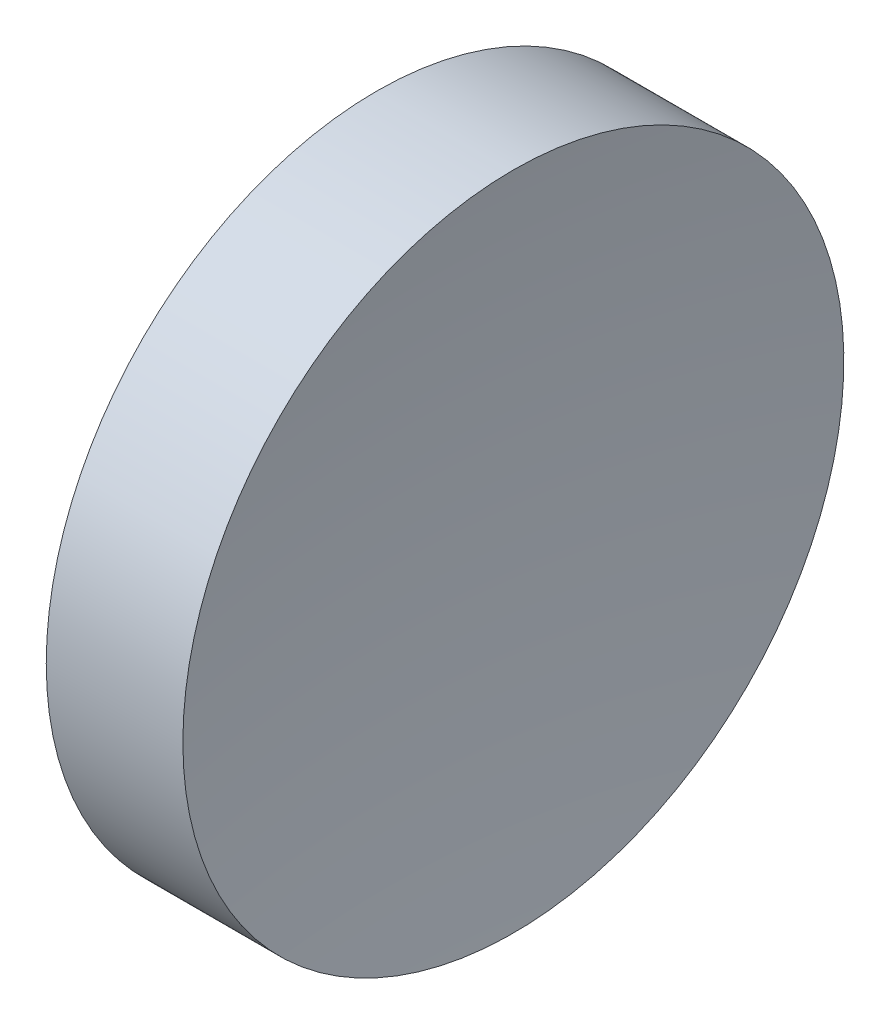
ISO-10303-21;
HEADER;
FILE_DESCRIPTION(('STEP AP214'),'2;1');
FILE_NAME('part.step','',(''),(''),'','','');
FILE_SCHEMA(('AUTOMOTIVE_DESIGN { 1 0 10303 214 1 1 1 1 }'));
ENDSEC;
DATA;
#1=APPLICATION_CONTEXT('core data for automotive mechanical design processes');
#2=APPLICATION_PROTOCOL_DEFINITION('international standard','automotive_design',2000,#1);
#3=PRODUCT_CONTEXT('',#1,'mechanical');
#4=PRODUCT('Part','Part','',(#3));
#5=PRODUCT_RELATED_PRODUCT_CATEGORY('part','',(#4));
#6=PRODUCT_DEFINITION_FORMATION('','',#4);
#7=PRODUCT_DEFINITION_CONTEXT('part definition',#1,'design');
#8=PRODUCT_DEFINITION('design','',#6,#7);
#9=PRODUCT_DEFINITION_SHAPE('','',#8);
#10=(LENGTH_UNIT() NAMED_UNIT(*) SI_UNIT(.MILLI.,.METRE.));
#11=(NAMED_UNIT(*) PLANE_ANGLE_UNIT() SI_UNIT($,.RADIAN.));
#12=(NAMED_UNIT(*) SI_UNIT($,.STERADIAN.) SOLID_ANGLE_UNIT());
#13=UNCERTAINTY_MEASURE_WITH_UNIT(LENGTH_MEASURE(1.E-05),#10,'distance_accuracy_value','');
#14=(GEOMETRIC_REPRESENTATION_CONTEXT(3) GLOBAL_UNCERTAINTY_ASSIGNED_CONTEXT((#13)) GLOBAL_UNIT_ASSIGNED_CONTEXT((#10,
#11,#12)) REPRESENTATION_CONTEXT('',''));
#15=CARTESIAN_POINT('',(0.,0.,0.));
#16=DIRECTION('',(0.,0.,1.));
#17=DIRECTION('',(1.,0.,0.));
#18=AXIS2_PLACEMENT_3D('',#15,#16,#17);
#19=CARTESIAN_POINT('',(214.452703446229,65.2226028729873,0.));
#20=DIRECTION('',(-1.,0.,0.));
#21=DIRECTION('',(0.,1.,0.));
#22=AXIS2_PLACEMENT_3D('',#19,#20,#21);
#23=SPHERICAL_SURFACE('',#22,92.6);
#24=CARTESIAN_POINT('',(122.72773410854,65.2226028729874,0.));
#25=DIRECTION('',(-1.,0.,0.));
#26=DIRECTION('',(0.,0.,1.));
#27=AXIS2_PLACEMENT_3D('',#24,#25,#26);
#28=CIRCLE('',#27,12.7);
#29=CARTESIAN_POINT('',(122.72773410854,65.2226028729874,12.7));
#30=VERTEX_POINT('',#29);
#31=EDGE_CURVE('E10',#30,#30,#28,.T.);
#32=ORIENTED_EDGE('',*,*,#31,.F.);
#33=EDGE_LOOP('',(#32));
#34=FACE_BOUND('',#33,.T.);
#35=ADVANCED_FACE('F35',(#34),#23,.F.);
#36=CARTESIAN_POINT('',(109.936935226086,65.2226028729874,0.));
#37=DIRECTION('',(-1.,0.,0.));
#38=DIRECTION('',(0.,0.,1.));
#39=AXIS2_PLACEMENT_3D('',#36,#37,#38);
#40=CYLINDRICAL_SURFACE('',#39,12.7);
#41=CARTESIAN_POINT('',(117.477672783918,65.2226028729874,0.));
#42=DIRECTION('',(-1.,0.,0.));
#43=DIRECTION('',(0.,0.,1.));
#44=AXIS2_PLACEMENT_3D('',#41,#42,#43);
#45=CIRCLE('',#44,12.7);
#46=CARTESIAN_POINT('',(117.477672783918,65.2226028729874,12.7));
#47=VERTEX_POINT('',#46);
#48=EDGE_CURVE('E41',#47,#47,#45,.T.);
#49=ORIENTED_EDGE('',*,*,#48,.F.);
#50=EDGE_LOOP('',(#49));
#51=FACE_BOUND('',#50,.T.);
#52=ORIENTED_EDGE('',*,*,#31,.T.);
#53=EDGE_LOOP('',(#52));
#54=FACE_BOUND('',#53,.T.);
#55=ADVANCED_FACE('F49',(#51,#54),#40,.T.);
#56=CARTESIAN_POINT('',(25.7527034462293,65.2226028729873,0.));
#57=DIRECTION('',(-1.,0.,0.));
#58=DIRECTION('',(0.,1.,0.));
#59=AXIS2_PLACEMENT_3D('',#56,#57,#58);
#60=SPHERICAL_SURFACE('',#59,92.6);
#61=ORIENTED_EDGE('',*,*,#48,.T.);
#62=EDGE_LOOP('',(#61));
#63=FACE_BOUND('',#62,.T.);
#64=ADVANCED_FACE('F47',(#63),#60,.F.);
#65=CLOSED_SHELL('',(#35,#55,#64));
#66=MANIFOLD_SOLID_BREP('B2',#65);
#67=ADVANCED_BREP_SHAPE_REPRESENTATION('',(#18,#66),#14);
#68=SHAPE_DEFINITION_REPRESENTATION(#9,#67);
ENDSEC;
END-ISO-10303-21;
